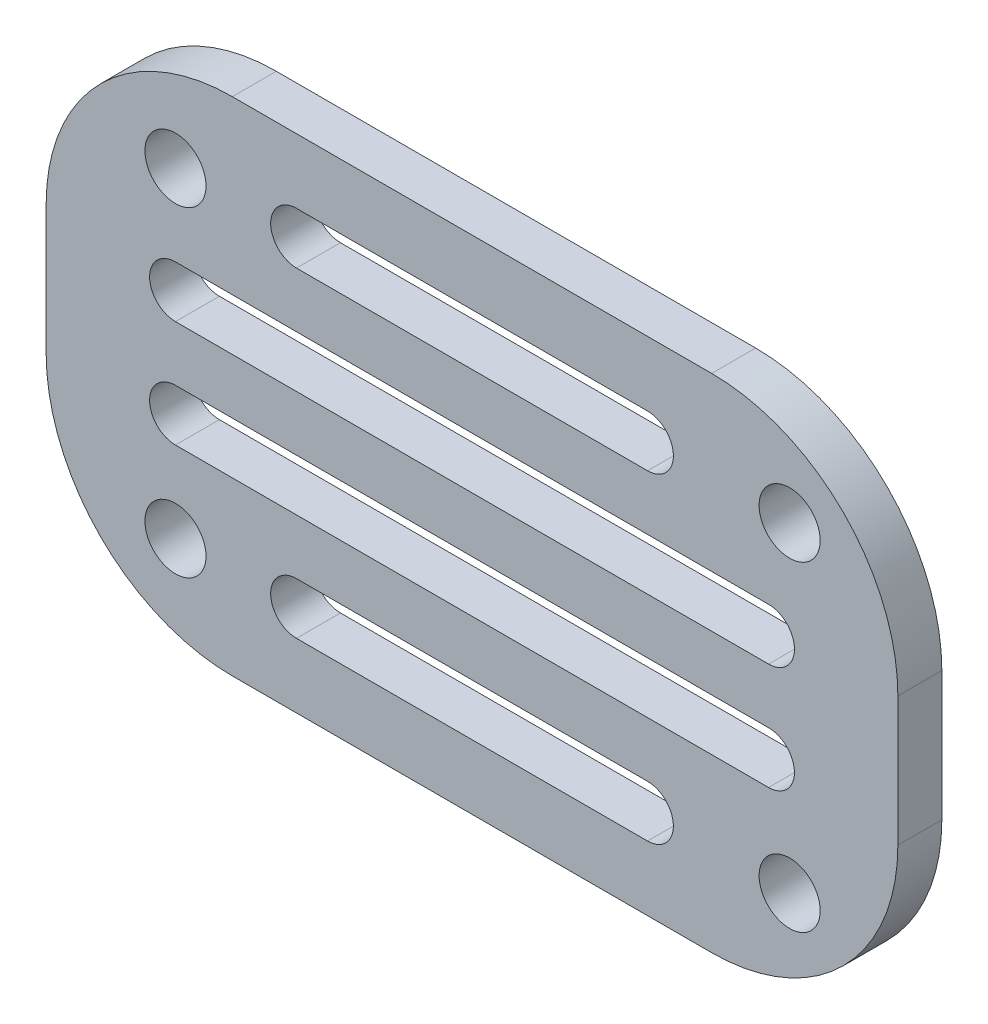
ISO-10303-21;
HEADER;
FILE_DESCRIPTION(('STEP AP214'),'2;1');
FILE_NAME('part.step','',(''),(''),'','','');
FILE_SCHEMA(('AUTOMOTIVE_DESIGN { 1 0 10303 214 1 1 1 1 }'));
ENDSEC;
DATA;
#1=APPLICATION_CONTEXT('core data for automotive mechanical design processes');
#2=APPLICATION_PROTOCOL_DEFINITION('international standard','automotive_design',2000,#1);
#3=PRODUCT_CONTEXT('',#1,'mechanical');
#4=PRODUCT('Part','Part','',(#3));
#5=PRODUCT_RELATED_PRODUCT_CATEGORY('part','',(#4));
#6=PRODUCT_DEFINITION_FORMATION('','',#4);
#7=PRODUCT_DEFINITION_CONTEXT('part definition',#1,'design');
#8=PRODUCT_DEFINITION('design','',#6,#7);
#9=PRODUCT_DEFINITION_SHAPE('','',#8);
#10=(LENGTH_UNIT() NAMED_UNIT(*) SI_UNIT(.MILLI.,.METRE.));
#11=(NAMED_UNIT(*) PLANE_ANGLE_UNIT() SI_UNIT($,.RADIAN.));
#12=(NAMED_UNIT(*) SI_UNIT($,.STERADIAN.) SOLID_ANGLE_UNIT());
#13=UNCERTAINTY_MEASURE_WITH_UNIT(LENGTH_MEASURE(1.E-05),#10,'distance_accuracy_value','');
#14=(GEOMETRIC_REPRESENTATION_CONTEXT(3) GLOBAL_UNCERTAINTY_ASSIGNED_CONTEXT((#13)) GLOBAL_UNIT_ASSIGNED_CONTEXT((#10,
#11,#12)) REPRESENTATION_CONTEXT('',''));
#15=CARTESIAN_POINT('',(0.,0.,0.));
#16=DIRECTION('',(0.,0.,1.));
#17=DIRECTION('',(1.,0.,0.));
#18=AXIS2_PLACEMENT_3D('',#15,#16,#17);
#19=CARTESIAN_POINT('',(-19.05,0.,2.159));
#20=DIRECTION('',(1.,0.,0.));
#21=DIRECTION('',(0.,0.,-1.));
#22=AXIS2_PLACEMENT_3D('',#19,#20,#21);
#23=PLANE('',#22);
#24=DIRECTION('',(0.,-1.,0.));
#25=VECTOR('',#24,1.);
#26=CARTESIAN_POINT('',(-19.05,0.,0.));
#27=LINE('',#26,#25);
#28=CARTESIAN_POINT('',(-19.05,3.17499999999999,0.));
#29=VERTEX_POINT('',#28);
#30=CARTESIAN_POINT('',(-19.05,-3.17499999999999,0.));
#31=VERTEX_POINT('',#30);
#32=EDGE_CURVE('E446',#29,#31,#27,.T.);
#33=ORIENTED_EDGE('',*,*,#32,.T.);
#34=DIRECTION('',(0.,0.,-1.));
#35=VECTOR('',#34,1.);
#36=CARTESIAN_POINT('',(-19.05,-3.17499999999999,2.159));
#37=LINE('',#36,#35);
#38=CARTESIAN_POINT('',(-19.05,-3.17499999999999,2.159));
#39=VERTEX_POINT('',#38);
#40=EDGE_CURVE('E11',#39,#31,#37,.T.);
#41=ORIENTED_EDGE('',*,*,#40,.F.);
#42=DIRECTION('',(0.,-1.,0.));
#43=VECTOR('',#42,1.);
#44=CARTESIAN_POINT('',(-19.05,0.,2.159));
#45=LINE('',#44,#43);
#46=CARTESIAN_POINT('',(-19.05,3.17499999999999,2.159));
#47=VERTEX_POINT('',#46);
#48=EDGE_CURVE('E402',#47,#39,#45,.T.);
#49=ORIENTED_EDGE('',*,*,#48,.F.);
#50=DIRECTION('',(0.,0.,-1.));
#51=VECTOR('',#50,1.);
#52=CARTESIAN_POINT('',(-19.05,3.17499999999999,2.159));
#53=LINE('',#52,#51);
#54=EDGE_CURVE('E430',#47,#29,#53,.T.);
#55=ORIENTED_EDGE('',*,*,#54,.T.);
#56=EDGE_LOOP('',(#33,#41,#49,#55));
#57=FACE_BOUND('',#56,.T.);
#58=ADVANCED_FACE('F41',(#57),#23,.F.);
#59=CARTESIAN_POINT('',(-9.906,-3.17499999999999,2.159));
#60=DIRECTION('',(0.,0.,-1.));
#61=DIRECTION('',(-1.,0.,0.));
#62=AXIS2_PLACEMENT_3D('',#59,#60,#61);
#63=CYLINDRICAL_SURFACE('',#62,9.144);
#64=CARTESIAN_POINT('',(-9.906,-3.17499999999999,0.));
#65=DIRECTION('',(0.,0.,1.));
#66=DIRECTION('',(1.,0.,0.));
#67=AXIS2_PLACEMENT_3D('',#64,#65,#66);
#68=CIRCLE('',#67,9.144);
#69=CARTESIAN_POINT('',(-9.906,-12.319,0.));
#70=VERTEX_POINT('',#69);
#71=EDGE_CURVE('E450',#31,#70,#68,.T.);
#72=ORIENTED_EDGE('',*,*,#71,.T.);
#73=DIRECTION('',(0.,0.,-1.));
#74=VECTOR('',#73,1.);
#75=CARTESIAN_POINT('',(-9.906,-12.319,2.159));
#76=LINE('',#75,#74);
#77=CARTESIAN_POINT('',(-9.906,-12.319,2.159));
#78=VERTEX_POINT('',#77);
#79=EDGE_CURVE('E50',#78,#70,#76,.T.);
#80=ORIENTED_EDGE('',*,*,#79,.F.);
#81=CARTESIAN_POINT('',(-9.906,-3.17499999999999,2.159));
#82=DIRECTION('',(0.,0.,1.));
#83=DIRECTION('',(1.,0.,0.));
#84=AXIS2_PLACEMENT_3D('',#81,#82,#83);
#85=CIRCLE('',#84,9.144);
#86=EDGE_CURVE('E406',#39,#78,#85,.T.);
#87=ORIENTED_EDGE('',*,*,#86,.F.);
#88=ORIENTED_EDGE('',*,*,#40,.T.);
#89=EDGE_LOOP('',(#72,#80,#87,#88));
#90=FACE_BOUND('',#89,.T.);
#91=ADVANCED_FACE('F515',(#90),#63,.T.);
#92=CARTESIAN_POINT('',(0.,-12.319,2.159));
#93=DIRECTION('',(0.,1.,0.));
#94=DIRECTION('',(0.,0.,1.));
#95=AXIS2_PLACEMENT_3D('',#92,#93,#94);
#96=PLANE('',#95);
#97=DIRECTION('',(1.,0.,0.));
#98=VECTOR('',#97,1.);
#99=CARTESIAN_POINT('',(0.,-12.319,0.));
#100=LINE('',#99,#98);
#101=CARTESIAN_POINT('',(13.6347258010329,-12.319,0.));
#102=VERTEX_POINT('',#101);
#103=EDGE_CURVE('E453',#70,#102,#100,.T.);
#104=ORIENTED_EDGE('',*,*,#103,.T.);
#105=DIRECTION('',(0.,0.,-1.));
#106=VECTOR('',#105,1.);
#107=CARTESIAN_POINT('',(13.6347258010329,-12.319,2.159));
#108=LINE('',#107,#106);
#109=CARTESIAN_POINT('',(13.6347258010329,-12.319,2.159));
#110=VERTEX_POINT('',#109);
#111=EDGE_CURVE('E489',#110,#102,#108,.T.);
#112=ORIENTED_EDGE('',*,*,#111,.F.);
#113=DIRECTION('',(1.,0.,0.));
#114=VECTOR('',#113,1.);
#115=CARTESIAN_POINT('',(0.,-12.319,2.159));
#116=LINE('',#115,#114);
#117=EDGE_CURVE('E409',#78,#110,#116,.T.);
#118=ORIENTED_EDGE('',*,*,#117,.F.);
#119=ORIENTED_EDGE('',*,*,#79,.T.);
#120=EDGE_LOOP('',(#104,#112,#118,#119));
#121=FACE_BOUND('',#120,.T.);
#122=ADVANCED_FACE('F498',(#121),#96,.F.);
#123=CARTESIAN_POINT('',(13.6347258010329,-3.175,2.159));
#124=DIRECTION('',(0.,0.,-1.));
#125=DIRECTION('',(-1.,0.,0.));
#126=AXIS2_PLACEMENT_3D('',#123,#124,#125);
#127=CYLINDRICAL_SURFACE('',#126,9.144);
#128=CARTESIAN_POINT('',(13.6347258010329,-3.175,0.));
#129=DIRECTION('',(0.,0.,1.));
#130=DIRECTION('',(1.,0.,0.));
#131=AXIS2_PLACEMENT_3D('',#128,#129,#130);
#132=CIRCLE('',#131,9.144);
#133=CARTESIAN_POINT('',(22.7787258010329,-3.175,0.));
#134=VERTEX_POINT('',#133);
#135=EDGE_CURVE('E456',#102,#134,#132,.T.);
#136=ORIENTED_EDGE('',*,*,#135,.T.);
#137=DIRECTION('',(0.,0.,-1.));
#138=VECTOR('',#137,1.);
#139=CARTESIAN_POINT('',(22.7787258010329,-3.175,2.159));
#140=LINE('',#139,#138);
#141=CARTESIAN_POINT('',(22.7787258010329,-3.175,2.159));
#142=VERTEX_POINT('',#141);
#143=EDGE_CURVE('E486',#142,#134,#140,.T.);
#144=ORIENTED_EDGE('',*,*,#143,.F.);
#145=CARTESIAN_POINT('',(13.6347258010329,-3.175,2.159));
#146=DIRECTION('',(0.,0.,1.));
#147=DIRECTION('',(1.,0.,0.));
#148=AXIS2_PLACEMENT_3D('',#145,#146,#147);
#149=CIRCLE('',#148,9.144);
#150=EDGE_CURVE('E412',#110,#142,#149,.T.);
#151=ORIENTED_EDGE('',*,*,#150,.F.);
#152=ORIENTED_EDGE('',*,*,#111,.T.);
#153=EDGE_LOOP('',(#136,#144,#151,#152));
#154=FACE_BOUND('',#153,.T.);
#155=ADVANCED_FACE('F507',(#154),#127,.T.);
#156=CARTESIAN_POINT('',(22.7787258010329,0.,2.159));
#157=DIRECTION('',(1.,0.,0.));
#158=DIRECTION('',(0.,0.,-1.));
#159=AXIS2_PLACEMENT_3D('',#156,#157,#158);
#160=PLANE('',#159);
#161=DIRECTION('',(0.,-1.,0.));
#162=VECTOR('',#161,1.);
#163=CARTESIAN_POINT('',(22.7787258010329,0.,0.));
#164=LINE('',#163,#162);
#165=CARTESIAN_POINT('',(22.7787258010329,3.175,0.));
#166=VERTEX_POINT('',#165);
#167=EDGE_CURVE('E460',#166,#134,#164,.T.);
#168=ORIENTED_EDGE('',*,*,#167,.F.);
#169=DIRECTION('',(0.,0.,-1.));
#170=VECTOR('',#169,1.);
#171=CARTESIAN_POINT('',(22.7787258010329,3.175,2.159));
#172=LINE('',#171,#170);
#173=CARTESIAN_POINT('',(22.7787258010329,3.175,2.159));
#174=VERTEX_POINT('',#173);
#175=EDGE_CURVE('E483',#174,#166,#172,.T.);
#176=ORIENTED_EDGE('',*,*,#175,.F.);
#177=DIRECTION('',(0.,-1.,0.));
#178=VECTOR('',#177,1.);
#179=CARTESIAN_POINT('',(22.7787258010329,0.,2.159));
#180=LINE('',#179,#178);
#181=EDGE_CURVE('E415',#174,#142,#180,.T.);
#182=ORIENTED_EDGE('',*,*,#181,.T.);
#183=ORIENTED_EDGE('',*,*,#143,.T.);
#184=EDGE_LOOP('',(#168,#176,#182,#183));
#185=FACE_BOUND('',#184,.T.);
#186=ADVANCED_FACE('F529',(#185),#160,.T.);
#187=CARTESIAN_POINT('',(13.6347258010329,3.175,2.159));
#188=DIRECTION('',(0.,0.,-1.));
#189=DIRECTION('',(-1.,0.,0.));
#190=AXIS2_PLACEMENT_3D('',#187,#188,#189);
#191=CYLINDRICAL_SURFACE('',#190,9.144);
#192=CARTESIAN_POINT('',(13.6347258010329,3.175,0.));
#193=DIRECTION('',(0.,0.,1.));
#194=DIRECTION('',(1.,0.,0.));
#195=AXIS2_PLACEMENT_3D('',#192,#193,#194);
#196=CIRCLE('',#195,9.144);
#197=CARTESIAN_POINT('',(13.6347258010329,12.319,0.));
#198=VERTEX_POINT('',#197);
#199=EDGE_CURVE('E464',#198,#166,#196,.F.);
#200=ORIENTED_EDGE('',*,*,#199,.F.);
#201=DIRECTION('',(0.,0.,-1.));
#202=VECTOR('',#201,1.);
#203=CARTESIAN_POINT('',(13.6347258010329,12.319,2.159));
#204=LINE('',#203,#202);
#205=CARTESIAN_POINT('',(13.6347258010329,12.319,2.159));
#206=VERTEX_POINT('',#205);
#207=EDGE_CURVE('E480',#206,#198,#204,.T.);
#208=ORIENTED_EDGE('',*,*,#207,.F.);
#209=CARTESIAN_POINT('',(13.6347258010329,3.175,2.159));
#210=DIRECTION('',(0.,0.,1.));
#211=DIRECTION('',(1.,0.,0.));
#212=AXIS2_PLACEMENT_3D('',#209,#210,#211);
#213=CIRCLE('',#212,9.144);
#214=EDGE_CURVE('E419',#206,#174,#213,.F.);
#215=ORIENTED_EDGE('',*,*,#214,.T.);
#216=ORIENTED_EDGE('',*,*,#175,.T.);
#217=EDGE_LOOP('',(#200,#208,#215,#216));
#218=FACE_BOUND('',#217,.T.);
#219=ADVANCED_FACE('F527',(#218),#191,.T.);
#220=CARTESIAN_POINT('',(0.,12.319,2.159));
#221=DIRECTION('',(0.,1.,0.));
#222=DIRECTION('',(0.,0.,1.));
#223=AXIS2_PLACEMENT_3D('',#220,#221,#222);
#224=PLANE('',#223);
#225=DIRECTION('',(1.,0.,0.));
#226=VECTOR('',#225,1.);
#227=CARTESIAN_POINT('',(0.,12.319,0.));
#228=LINE('',#227,#226);
#229=CARTESIAN_POINT('',(-9.906,12.319,0.));
#230=VERTEX_POINT('',#229);
#231=EDGE_CURVE('E468',#230,#198,#228,.T.);
#232=ORIENTED_EDGE('',*,*,#231,.F.);
#233=DIRECTION('',(0.,0.,-1.));
#234=VECTOR('',#233,1.);
#235=CARTESIAN_POINT('',(-9.906,12.319,2.159));
#236=LINE('',#235,#234);
#237=CARTESIAN_POINT('',(-9.906,12.319,2.159));
#238=VERTEX_POINT('',#237);
#239=EDGE_CURVE('E477',#238,#230,#236,.T.);
#240=ORIENTED_EDGE('',*,*,#239,.F.);
#241=DIRECTION('',(1.,0.,0.));
#242=VECTOR('',#241,1.);
#243=CARTESIAN_POINT('',(0.,12.319,2.159));
#244=LINE('',#243,#242);
#245=EDGE_CURVE('E423',#238,#206,#244,.T.);
#246=ORIENTED_EDGE('',*,*,#245,.T.);
#247=ORIENTED_EDGE('',*,*,#207,.T.);
#248=EDGE_LOOP('',(#232,#240,#246,#247));
#249=FACE_BOUND('',#248,.T.);
#250=ADVANCED_FACE('F522',(#249),#224,.T.);
#251=CARTESIAN_POINT('',(17.4625,-7.874,2.159));
#252=DIRECTION('',(0.,0.,-1.));
#253=DIRECTION('',(-1.,0.,0.));
#254=AXIS2_PLACEMENT_3D('',#251,#252,#253);
#255=CYLINDRICAL_SURFACE('',#254,1.5);
#256=CARTESIAN_POINT('',(17.4625,-7.874,2.159));
#257=DIRECTION('',(0.,0.,1.));
#258=DIRECTION('',(1.,0.,0.));
#259=AXIS2_PLACEMENT_3D('',#256,#257,#258);
#260=CIRCLE('',#259,1.5);
#261=CARTESIAN_POINT('',(18.9625,-7.874,2.159));
#262=VERTEX_POINT('',#261);
#263=EDGE_CURVE('E398',#262,#262,#260,.T.);
#264=ORIENTED_EDGE('',*,*,#263,.T.);
#265=EDGE_LOOP('',(#264));
#266=FACE_BOUND('',#265,.T.);
#267=CARTESIAN_POINT('',(17.4625,-7.874,0.));
#268=DIRECTION('',(0.,0.,1.));
#269=DIRECTION('',(1.,0.,0.));
#270=AXIS2_PLACEMENT_3D('',#267,#268,#269);
#271=CIRCLE('',#270,1.5);
#272=CARTESIAN_POINT('',(18.9625,-7.874,0.));
#273=VERTEX_POINT('',#272);
#274=EDGE_CURVE('E442',#273,#273,#271,.T.);
#275=ORIENTED_EDGE('',*,*,#274,.F.);
#276=EDGE_LOOP('',(#275));
#277=FACE_BOUND('',#276,.T.);
#278=ADVANCED_FACE('F546',(#266,#277),#255,.F.);
#279=CARTESIAN_POINT('',(17.4625,7.874,2.159));
#280=DIRECTION('',(0.,0.,-1.));
#281=DIRECTION('',(-1.,0.,0.));
#282=AXIS2_PLACEMENT_3D('',#279,#280,#281);
#283=CYLINDRICAL_SURFACE('',#282,1.5);
#284=CARTESIAN_POINT('',(17.4625,7.874,2.159));
#285=DIRECTION('',(0.,0.,1.));
#286=DIRECTION('',(1.,0.,0.));
#287=AXIS2_PLACEMENT_3D('',#284,#285,#286);
#288=CIRCLE('',#287,1.5);
#289=CARTESIAN_POINT('',(18.9625,7.874,2.159));
#290=VERTEX_POINT('',#289);
#291=EDGE_CURVE('E394',#290,#290,#288,.T.);
#292=ORIENTED_EDGE('',*,*,#291,.T.);
#293=EDGE_LOOP('',(#292));
#294=FACE_BOUND('',#293,.T.);
#295=CARTESIAN_POINT('',(17.4625,7.874,0.));
#296=DIRECTION('',(0.,0.,1.));
#297=DIRECTION('',(1.,0.,0.));
#298=AXIS2_PLACEMENT_3D('',#295,#296,#297);
#299=CIRCLE('',#298,1.5);
#300=CARTESIAN_POINT('',(18.9625,7.874,0.));
#301=VERTEX_POINT('',#300);
#302=EDGE_CURVE('E438',#301,#301,#299,.T.);
#303=ORIENTED_EDGE('',*,*,#302,.F.);
#304=EDGE_LOOP('',(#303));
#305=FACE_BOUND('',#304,.T.);
#306=ADVANCED_FACE('F549',(#294,#305),#283,.F.);
#307=CARTESIAN_POINT('',(-12.7,-7.874,2.159));
#308=DIRECTION('',(0.,0.,-1.));
#309=DIRECTION('',(-1.,0.,0.));
#310=AXIS2_PLACEMENT_3D('',#307,#308,#309);
#311=CYLINDRICAL_SURFACE('',#310,1.5);
#312=CARTESIAN_POINT('',(-12.7,-7.874,2.159));
#313=DIRECTION('',(0.,0.,1.));
#314=DIRECTION('',(1.,0.,0.));
#315=AXIS2_PLACEMENT_3D('',#312,#313,#314);
#316=CIRCLE('',#315,1.5);
#317=CARTESIAN_POINT('',(-11.2,-7.874,2.159));
#318=VERTEX_POINT('',#317);
#319=EDGE_CURVE('E389',#318,#318,#316,.T.);
#320=ORIENTED_EDGE('',*,*,#319,.T.);
#321=EDGE_LOOP('',(#320));
#322=FACE_BOUND('',#321,.T.);
#323=CARTESIAN_POINT('',(-12.7,-7.874,0.));
#324=DIRECTION('',(0.,0.,1.));
#325=DIRECTION('',(1.,0.,0.));
#326=AXIS2_PLACEMENT_3D('',#323,#324,#325);
#327=CIRCLE('',#326,1.5);
#328=CARTESIAN_POINT('',(-11.2,-7.874,0.));
#329=VERTEX_POINT('',#328);
#330=EDGE_CURVE('E434',#329,#329,#327,.T.);
#331=ORIENTED_EDGE('',*,*,#330,.F.);
#332=EDGE_LOOP('',(#331));
#333=FACE_BOUND('',#332,.T.);
#334=ADVANCED_FACE('F552',(#322,#333),#311,.F.);
#335=CARTESIAN_POINT('',(-12.7,7.874,2.159));
#336=DIRECTION('',(0.,0.,-1.));
#337=DIRECTION('',(-1.,0.,0.));
#338=AXIS2_PLACEMENT_3D('',#335,#336,#337);
#339=CYLINDRICAL_SURFACE('',#338,1.5);
#340=CARTESIAN_POINT('',(-12.7,7.874,2.159));
#341=DIRECTION('',(0.,0.,1.));
#342=DIRECTION('',(1.,0.,0.));
#343=AXIS2_PLACEMENT_3D('',#340,#341,#342);
#344=CIRCLE('',#343,1.5);
#345=CARTESIAN_POINT('',(-11.2,7.874,2.159));
#346=VERTEX_POINT('',#345);
#347=EDGE_CURVE('E385',#346,#346,#344,.T.);
#348=ORIENTED_EDGE('',*,*,#347,.T.);
#349=EDGE_LOOP('',(#348));
#350=FACE_BOUND('',#349,.T.);
#351=CARTESIAN_POINT('',(-12.7,7.874,0.));
#352=DIRECTION('',(0.,0.,1.));
#353=DIRECTION('',(1.,0.,0.));
#354=AXIS2_PLACEMENT_3D('',#351,#352,#353);
#355=CIRCLE('',#354,1.5);
#356=CARTESIAN_POINT('',(-11.2,7.874,0.));
#357=VERTEX_POINT('',#356);
#358=EDGE_CURVE('E250',#357,#357,#355,.T.);
#359=ORIENTED_EDGE('',*,*,#358,.F.);
#360=EDGE_LOOP('',(#359));
#361=FACE_BOUND('',#360,.T.);
#362=ADVANCED_FACE('F43',(#350,#361),#339,.F.);
#363=CARTESIAN_POINT('',(-9.906,3.17499999999999,2.159));
#364=DIRECTION('',(0.,0.,-1.));
#365=DIRECTION('',(-1.,0.,0.));
#366=AXIS2_PLACEMENT_3D('',#363,#364,#365);
#367=CYLINDRICAL_SURFACE('',#366,9.144);
#368=CARTESIAN_POINT('',(-9.906,3.17499999999999,0.));
#369=DIRECTION('',(0.,0.,1.));
#370=DIRECTION('',(1.,0.,0.));
#371=AXIS2_PLACEMENT_3D('',#368,#369,#370);
#372=CIRCLE('',#371,9.144);
#373=EDGE_CURVE('E390',#230,#29,#372,.T.);
#374=ORIENTED_EDGE('',*,*,#373,.T.);
#375=ORIENTED_EDGE('',*,*,#54,.F.);
#376=CARTESIAN_POINT('',(-9.906,3.17499999999999,2.159));
#377=DIRECTION('',(0.,0.,1.));
#378=DIRECTION('',(1.,0.,0.));
#379=AXIS2_PLACEMENT_3D('',#376,#377,#378);
#380=CIRCLE('',#379,9.144);
#381=EDGE_CURVE('E427',#238,#47,#380,.T.);
#382=ORIENTED_EDGE('',*,*,#381,.F.);
#383=ORIENTED_EDGE('',*,*,#239,.T.);
#384=EDGE_LOOP('',(#374,#375,#382,#383));
#385=FACE_BOUND('',#384,.T.);
#386=ADVANCED_FACE('F559',(#385),#367,.T.);
#387=CARTESIAN_POINT('',(0.,0.,2.159));
#388=DIRECTION('',(0.,0.,1.));
#389=DIRECTION('',(1.,0.,0.));
#390=AXIS2_PLACEMENT_3D('',#387,#388,#389);
#391=PLANE('',#390);
#392=CARTESIAN_POINT('',(-6.755,7.87399999999999,2.159));
#393=DIRECTION('',(0.,0.,1.));
#394=DIRECTION('',(1.,0.,0.));
#395=AXIS2_PLACEMENT_3D('',#392,#393,#394);
#396=CIRCLE('',#395,1.27);
#397=CARTESIAN_POINT('',(-6.755,9.14399999999999,2.159));
#398=VERTEX_POINT('',#397);
#399=CARTESIAN_POINT('',(-6.755,6.604,2.159));
#400=VERTEX_POINT('',#399);
#401=EDGE_CURVE('E57',#398,#400,#396,.T.);
#402=ORIENTED_EDGE('',*,*,#401,.F.);
#403=DIRECTION('',(-1.,0.,0.));
#404=VECTOR('',#403,1.);
#405=CARTESIAN_POINT('',(-6.755,9.14399999999999,2.159));
#406=LINE('',#405,#404);
#407=CARTESIAN_POINT('',(10.4837258010329,9.14399999999999,2.159));
#408=VERTEX_POINT('',#407);
#409=EDGE_CURVE('E227',#408,#398,#406,.T.);
#410=ORIENTED_EDGE('',*,*,#409,.F.);
#411=CARTESIAN_POINT('',(10.4837258010329,7.87399999999999,2.159));
#412=DIRECTION('',(0.,0.,1.));
#413=DIRECTION('',(1.,0.,0.));
#414=AXIS2_PLACEMENT_3D('',#411,#412,#413);
#415=CIRCLE('',#414,1.27);
#416=CARTESIAN_POINT('',(10.4837258010329,6.604,2.159));
#417=VERTEX_POINT('',#416);
#418=EDGE_CURVE('E231',#417,#408,#415,.T.);
#419=ORIENTED_EDGE('',*,*,#418,.F.);
#420=DIRECTION('',(1.,0.,0.));
#421=VECTOR('',#420,1.);
#422=CARTESIAN_POINT('',(-6.755,6.604,2.159));
#423=LINE('',#422,#421);
#424=EDGE_CURVE('E240',#400,#417,#423,.T.);
#425=ORIENTED_EDGE('',*,*,#424,.F.);
#426=EDGE_LOOP('',(#402,#410,#419,#425));
#427=FACE_BOUND('',#426,.T.);
#428=CARTESIAN_POINT('',(-12.7,2.62466666666666,2.159));
#429=DIRECTION('',(0.,0.,1.));
#430=DIRECTION('',(1.,0.,0.));
#431=AXIS2_PLACEMENT_3D('',#428,#429,#430);
#432=CIRCLE('',#431,1.27);
#433=CARTESIAN_POINT('',(-12.7,3.89466666666667,2.159));
#434=VERTEX_POINT('',#433);
#435=CARTESIAN_POINT('',(-12.7,1.35466666666666,2.159));
#436=VERTEX_POINT('',#435);
#437=EDGE_CURVE('E65',#434,#436,#432,.T.);
#438=ORIENTED_EDGE('',*,*,#437,.F.);
#439=DIRECTION('',(-1.,0.,0.));
#440=VECTOR('',#439,1.);
#441=CARTESIAN_POINT('',(-12.7,3.89466666666667,2.159));
#442=LINE('',#441,#440);
#443=CARTESIAN_POINT('',(16.4287258010329,3.89466666666667,2.159));
#444=VERTEX_POINT('',#443);
#445=EDGE_CURVE('E261',#444,#434,#442,.T.);
#446=ORIENTED_EDGE('',*,*,#445,.F.);
#447=CARTESIAN_POINT('',(16.4287258010329,2.62466666666667,2.159));
#448=DIRECTION('',(0.,0.,1.));
#449=DIRECTION('',(1.,0.,0.));
#450=AXIS2_PLACEMENT_3D('',#447,#448,#449);
#451=CIRCLE('',#450,1.27);
#452=CARTESIAN_POINT('',(16.4287258010329,1.35466666666667,2.159));
#453=VERTEX_POINT('',#452);
#454=EDGE_CURVE('E281',#453,#444,#451,.T.);
#455=ORIENTED_EDGE('',*,*,#454,.F.);
#456=DIRECTION('',(1.,0.,0.));
#457=VECTOR('',#456,1.);
#458=CARTESIAN_POINT('',(-12.7,1.35466666666666,2.159));
#459=LINE('',#458,#457);
#460=EDGE_CURVE('E276',#436,#453,#459,.T.);
#461=ORIENTED_EDGE('',*,*,#460,.F.);
#462=EDGE_LOOP('',(#438,#446,#455,#461));
#463=FACE_BOUND('',#462,.T.);
#464=CARTESIAN_POINT('',(-12.7,-2.62466666666666,2.159));
#465=DIRECTION('',(0.,0.,1.));
#466=DIRECTION('',(1.,0.,0.));
#467=AXIS2_PLACEMENT_3D('',#464,#465,#466);
#468=CIRCLE('',#467,1.27);
#469=CARTESIAN_POINT('',(-12.7,-1.35466666666666,2.159));
#470=VERTEX_POINT('',#469);
#471=CARTESIAN_POINT('',(-12.7,-3.89466666666666,2.159));
#472=VERTEX_POINT('',#471);
#473=EDGE_CURVE('E316',#470,#472,#468,.T.);
#474=ORIENTED_EDGE('',*,*,#473,.F.);
#475=DIRECTION('',(-1.,0.,0.));
#476=VECTOR('',#475,1.);
#477=CARTESIAN_POINT('',(-12.7,-1.35466666666666,2.159));
#478=LINE('',#477,#476);
#479=CARTESIAN_POINT('',(16.4287258010329,-1.35466666666666,2.159));
#480=VERTEX_POINT('',#479);
#481=EDGE_CURVE('E303',#480,#470,#478,.T.);
#482=ORIENTED_EDGE('',*,*,#481,.F.);
#483=CARTESIAN_POINT('',(16.4287258010329,-2.62466666666666,2.159));
#484=DIRECTION('',(0.,0.,1.));
#485=DIRECTION('',(1.,0.,0.));
#486=AXIS2_PLACEMENT_3D('',#483,#484,#485);
#487=CIRCLE('',#486,1.27);
#488=CARTESIAN_POINT('',(16.4287258010329,-3.89466666666666,2.159));
#489=VERTEX_POINT('',#488);
#490=EDGE_CURVE('E324',#489,#480,#487,.T.);
#491=ORIENTED_EDGE('',*,*,#490,.F.);
#492=DIRECTION('',(1.,0.,0.));
#493=VECTOR('',#492,1.);
#494=CARTESIAN_POINT('',(-12.7,-3.89466666666666,2.159));
#495=LINE('',#494,#493);
#496=EDGE_CURVE('E319',#472,#489,#495,.T.);
#497=ORIENTED_EDGE('',*,*,#496,.F.);
#498=EDGE_LOOP('',(#474,#482,#491,#497));
#499=FACE_BOUND('',#498,.T.);
#500=CARTESIAN_POINT('',(-6.75499999999999,-7.87399999999999,2.159));
#501=DIRECTION('',(0.,0.,1.));
#502=DIRECTION('',(1.,0.,0.));
#503=AXIS2_PLACEMENT_3D('',#500,#501,#502);
#504=CIRCLE('',#503,1.27);
#505=CARTESIAN_POINT('',(-6.75499999999999,-6.60399999999999,2.159));
#506=VERTEX_POINT('',#505);
#507=CARTESIAN_POINT('',(-6.75499999999999,-9.14399999999999,2.159));
#508=VERTEX_POINT('',#507);
#509=EDGE_CURVE('E360',#506,#508,#504,.T.);
#510=ORIENTED_EDGE('',*,*,#509,.F.);
#511=DIRECTION('',(-1.,0.,0.));
#512=VECTOR('',#511,1.);
#513=CARTESIAN_POINT('',(-6.75499999999999,-6.60399999999999,2.159));
#514=LINE('',#513,#512);
#515=CARTESIAN_POINT('',(10.4837258010329,-6.60399999999999,2.159));
#516=VERTEX_POINT('',#515);
#517=EDGE_CURVE('E347',#516,#506,#514,.T.);
#518=ORIENTED_EDGE('',*,*,#517,.F.);
#519=CARTESIAN_POINT('',(10.4837258010329,-7.87399999999999,2.159));
#520=DIRECTION('',(0.,0.,1.));
#521=DIRECTION('',(1.,0.,0.));
#522=AXIS2_PLACEMENT_3D('',#519,#520,#521);
#523=CIRCLE('',#522,1.27);
#524=CARTESIAN_POINT('',(10.4837258010329,-9.14399999999999,2.159));
#525=VERTEX_POINT('',#524);
#526=EDGE_CURVE('E367',#525,#516,#523,.T.);
#527=ORIENTED_EDGE('',*,*,#526,.F.);
#528=DIRECTION('',(1.,0.,0.));
#529=VECTOR('',#528,1.);
#530=CARTESIAN_POINT('',(-6.75499999999999,-9.14399999999999,2.159));
#531=LINE('',#530,#529);
#532=EDGE_CURVE('E363',#508,#525,#531,.T.);
#533=ORIENTED_EDGE('',*,*,#532,.F.);
#534=EDGE_LOOP('',(#510,#518,#527,#533));
#535=FACE_BOUND('',#534,.T.);
#536=ORIENTED_EDGE('',*,*,#347,.F.);
#537=EDGE_LOOP('',(#536));
#538=FACE_BOUND('',#537,.T.);
#539=ORIENTED_EDGE('',*,*,#319,.F.);
#540=EDGE_LOOP('',(#539));
#541=FACE_BOUND('',#540,.T.);
#542=ORIENTED_EDGE('',*,*,#291,.F.);
#543=EDGE_LOOP('',(#542));
#544=FACE_BOUND('',#543,.T.);
#545=ORIENTED_EDGE('',*,*,#263,.F.);
#546=EDGE_LOOP('',(#545));
#547=FACE_BOUND('',#546,.T.);
#548=ORIENTED_EDGE('',*,*,#48,.T.);
#549=ORIENTED_EDGE('',*,*,#86,.T.);
#550=ORIENTED_EDGE('',*,*,#117,.T.);
#551=ORIENTED_EDGE('',*,*,#150,.T.);
#552=ORIENTED_EDGE('',*,*,#181,.F.);
#553=ORIENTED_EDGE('',*,*,#214,.F.);
#554=ORIENTED_EDGE('',*,*,#245,.F.);
#555=ORIENTED_EDGE('',*,*,#381,.T.);
#556=EDGE_LOOP('',(#548,#549,#550,#551,#552,#553,#554,#555));
#557=FACE_BOUND('',#556,.T.);
#558=ADVANCED_FACE('F511',(#427,#463,#499,#535,#538,#541,#544,#547,#557),#391,.T.);
#559=CARTESIAN_POINT('',(0.,0.,0.));
#560=DIRECTION('',(0.,0.,1.));
#561=DIRECTION('',(1.,0.,0.));
#562=AXIS2_PLACEMENT_3D('',#559,#560,#561);
#563=PLANE('',#562);
#564=DIRECTION('',(-1.,0.,0.));
#565=VECTOR('',#564,1.);
#566=CARTESIAN_POINT('',(-6.755,9.14399999999999,0.));
#567=LINE('',#566,#565);
#568=CARTESIAN_POINT('',(10.4837258010329,9.14399999999999,0.));
#569=VERTEX_POINT('',#568);
#570=CARTESIAN_POINT('',(-6.755,9.14399999999999,0.));
#571=VERTEX_POINT('',#570);
#572=EDGE_CURVE('E212',#569,#571,#567,.T.);
#573=ORIENTED_EDGE('',*,*,#572,.T.);
#574=CARTESIAN_POINT('',(-6.755,7.87399999999999,0.));
#575=DIRECTION('',(0.,0.,1.));
#576=DIRECTION('',(1.,0.,0.));
#577=AXIS2_PLACEMENT_3D('',#574,#575,#576);
#578=CIRCLE('',#577,1.27);
#579=CARTESIAN_POINT('',(-6.755,6.604,0.));
#580=VERTEX_POINT('',#579);
#581=EDGE_CURVE('E205',#571,#580,#578,.T.);
#582=ORIENTED_EDGE('',*,*,#581,.T.);
#583=DIRECTION('',(1.,0.,0.));
#584=VECTOR('',#583,1.);
#585=CARTESIAN_POINT('',(-6.755,6.604,0.));
#586=LINE('',#585,#584);
#587=CARTESIAN_POINT('',(10.4837258010329,6.604,0.));
#588=VERTEX_POINT('',#587);
#589=EDGE_CURVE('E216',#580,#588,#586,.T.);
#590=ORIENTED_EDGE('',*,*,#589,.T.);
#591=CARTESIAN_POINT('',(10.4837258010329,7.87399999999999,0.));
#592=DIRECTION('',(0.,0.,1.));
#593=DIRECTION('',(1.,0.,0.));
#594=AXIS2_PLACEMENT_3D('',#591,#592,#593);
#595=CIRCLE('',#594,1.27);
#596=EDGE_CURVE('E221',#588,#569,#595,.T.);
#597=ORIENTED_EDGE('',*,*,#596,.T.);
#598=EDGE_LOOP('',(#573,#582,#590,#597));
#599=FACE_BOUND('',#598,.T.);
#600=DIRECTION('',(-1.,0.,0.));
#601=VECTOR('',#600,1.);
#602=CARTESIAN_POINT('',(-12.7,3.89466666666667,0.));
#603=LINE('',#602,#601);
#604=CARTESIAN_POINT('',(16.4287258010329,3.89466666666667,0.));
#605=VERTEX_POINT('',#604);
#606=CARTESIAN_POINT('',(-12.7,3.89466666666667,0.));
#607=VERTEX_POINT('',#606);
#608=EDGE_CURVE('E269',#605,#607,#603,.T.);
#609=ORIENTED_EDGE('',*,*,#608,.T.);
#610=CARTESIAN_POINT('',(-12.7,2.62466666666666,0.));
#611=DIRECTION('',(0.,0.,1.));
#612=DIRECTION('',(1.,0.,0.));
#613=AXIS2_PLACEMENT_3D('',#610,#611,#612);
#614=CIRCLE('',#613,1.27);
#615=CARTESIAN_POINT('',(-12.7,1.35466666666666,0.));
#616=VERTEX_POINT('',#615);
#617=EDGE_CURVE('E256',#607,#616,#614,.T.);
#618=ORIENTED_EDGE('',*,*,#617,.T.);
#619=DIRECTION('',(1.,0.,0.));
#620=VECTOR('',#619,1.);
#621=CARTESIAN_POINT('',(-12.7,1.35466666666666,0.));
#622=LINE('',#621,#620);
#623=CARTESIAN_POINT('',(16.4287258010329,1.35466666666667,0.));
#624=VERTEX_POINT('',#623);
#625=EDGE_CURVE('E260',#616,#624,#622,.T.);
#626=ORIENTED_EDGE('',*,*,#625,.T.);
#627=CARTESIAN_POINT('',(16.4287258010329,2.62466666666667,0.));
#628=DIRECTION('',(0.,0.,1.));
#629=DIRECTION('',(1.,0.,0.));
#630=AXIS2_PLACEMENT_3D('',#627,#628,#629);
#631=CIRCLE('',#630,1.27);
#632=EDGE_CURVE('E265',#624,#605,#631,.T.);
#633=ORIENTED_EDGE('',*,*,#632,.T.);
#634=EDGE_LOOP('',(#609,#618,#626,#633));
#635=FACE_BOUND('',#634,.T.);
#636=DIRECTION('',(-1.,0.,0.));
#637=VECTOR('',#636,1.);
#638=CARTESIAN_POINT('',(-12.7,-1.35466666666666,0.));
#639=LINE('',#638,#637);
#640=CARTESIAN_POINT('',(16.4287258010329,-1.35466666666666,0.));
#641=VERTEX_POINT('',#640);
#642=CARTESIAN_POINT('',(-12.7,-1.35466666666666,0.));
#643=VERTEX_POINT('',#642);
#644=EDGE_CURVE('E311',#641,#643,#639,.T.);
#645=ORIENTED_EDGE('',*,*,#644,.T.);
#646=CARTESIAN_POINT('',(-12.7,-2.62466666666666,0.));
#647=DIRECTION('',(0.,0.,1.));
#648=DIRECTION('',(1.,0.,0.));
#649=AXIS2_PLACEMENT_3D('',#646,#647,#648);
#650=CIRCLE('',#649,1.27);
#651=CARTESIAN_POINT('',(-12.7,-3.89466666666666,0.));
#652=VERTEX_POINT('',#651);
#653=EDGE_CURVE('E298',#643,#652,#650,.T.);
#654=ORIENTED_EDGE('',*,*,#653,.T.);
#655=DIRECTION('',(1.,0.,0.));
#656=VECTOR('',#655,1.);
#657=CARTESIAN_POINT('',(-12.7,-3.89466666666666,0.));
#658=LINE('',#657,#656);
#659=CARTESIAN_POINT('',(16.4287258010329,-3.89466666666666,0.));
#660=VERTEX_POINT('',#659);
#661=EDGE_CURVE('E302',#652,#660,#658,.T.);
#662=ORIENTED_EDGE('',*,*,#661,.T.);
#663=CARTESIAN_POINT('',(16.4287258010329,-2.62466666666666,0.));
#664=DIRECTION('',(0.,0.,1.));
#665=DIRECTION('',(1.,0.,0.));
#666=AXIS2_PLACEMENT_3D('',#663,#664,#665);
#667=CIRCLE('',#666,1.27);
#668=EDGE_CURVE('E307',#660,#641,#667,.T.);
#669=ORIENTED_EDGE('',*,*,#668,.T.);
#670=EDGE_LOOP('',(#645,#654,#662,#669));
#671=FACE_BOUND('',#670,.T.);
#672=DIRECTION('',(-1.,0.,0.));
#673=VECTOR('',#672,1.);
#674=CARTESIAN_POINT('',(-6.75499999999999,-6.60399999999999,0.));
#675=LINE('',#674,#673);
#676=CARTESIAN_POINT('',(10.4837258010329,-6.60399999999999,0.));
#677=VERTEX_POINT('',#676);
#678=CARTESIAN_POINT('',(-6.75499999999999,-6.60399999999999,0.));
#679=VERTEX_POINT('',#678);
#680=EDGE_CURVE('E355',#677,#679,#675,.T.);
#681=ORIENTED_EDGE('',*,*,#680,.T.);
#682=CARTESIAN_POINT('',(-6.75499999999999,-7.87399999999999,0.));
#683=DIRECTION('',(0.,0.,1.));
#684=DIRECTION('',(1.,0.,0.));
#685=AXIS2_PLACEMENT_3D('',#682,#683,#684);
#686=CIRCLE('',#685,1.27);
#687=CARTESIAN_POINT('',(-6.75499999999999,-9.14399999999999,0.));
#688=VERTEX_POINT('',#687);
#689=EDGE_CURVE('E342',#679,#688,#686,.T.);
#690=ORIENTED_EDGE('',*,*,#689,.T.);
#691=DIRECTION('',(1.,0.,0.));
#692=VECTOR('',#691,1.);
#693=CARTESIAN_POINT('',(-6.75499999999999,-9.14399999999999,0.));
#694=LINE('',#693,#692);
#695=CARTESIAN_POINT('',(10.4837258010329,-9.14399999999999,0.));
#696=VERTEX_POINT('',#695);
#697=EDGE_CURVE('E346',#688,#696,#694,.T.);
#698=ORIENTED_EDGE('',*,*,#697,.T.);
#699=CARTESIAN_POINT('',(10.4837258010329,-7.87399999999999,0.));
#700=DIRECTION('',(0.,0.,1.));
#701=DIRECTION('',(1.,0.,0.));
#702=AXIS2_PLACEMENT_3D('',#699,#700,#701);
#703=CIRCLE('',#702,1.27);
#704=EDGE_CURVE('E351',#696,#677,#703,.T.);
#705=ORIENTED_EDGE('',*,*,#704,.T.);
#706=EDGE_LOOP('',(#681,#690,#698,#705));
#707=FACE_BOUND('',#706,.T.);
#708=ORIENTED_EDGE('',*,*,#358,.T.);
#709=EDGE_LOOP('',(#708));
#710=FACE_BOUND('',#709,.T.);
#711=ORIENTED_EDGE('',*,*,#330,.T.);
#712=EDGE_LOOP('',(#711));
#713=FACE_BOUND('',#712,.T.);
#714=ORIENTED_EDGE('',*,*,#302,.T.);
#715=EDGE_LOOP('',(#714));
#716=FACE_BOUND('',#715,.T.);
#717=ORIENTED_EDGE('',*,*,#274,.T.);
#718=EDGE_LOOP('',(#717));
#719=FACE_BOUND('',#718,.T.);
#720=ORIENTED_EDGE('',*,*,#32,.F.);
#721=ORIENTED_EDGE('',*,*,#373,.F.);
#722=ORIENTED_EDGE('',*,*,#231,.T.);
#723=ORIENTED_EDGE('',*,*,#199,.T.);
#724=ORIENTED_EDGE('',*,*,#167,.T.);
#725=ORIENTED_EDGE('',*,*,#135,.F.);
#726=ORIENTED_EDGE('',*,*,#103,.F.);
#727=ORIENTED_EDGE('',*,*,#71,.F.);
#728=EDGE_LOOP('',(#720,#721,#722,#723,#724,#725,#726,#727));
#729=FACE_BOUND('',#728,.T.);
#730=ADVANCED_FACE('F223',(#599,#635,#671,#707,#710,#713,#716,#719,#729),#563,.F.);
#731=CARTESIAN_POINT('',(-6.75499999999999,-7.87399999999999,0.));
#732=DIRECTION('',(0.,0.,1.));
#733=DIRECTION('',(1.,0.,0.));
#734=AXIS2_PLACEMENT_3D('',#731,#732,#733);
#735=CYLINDRICAL_SURFACE('',#734,1.27);
#736=ORIENTED_EDGE('',*,*,#509,.T.);
#737=DIRECTION('',(0.,0.,1.));
#738=VECTOR('',#737,1.);
#739=CARTESIAN_POINT('',(-6.75499999999999,-9.14399999999999,0.));
#740=LINE('',#739,#738);
#741=EDGE_CURVE('E359',#688,#508,#740,.T.);
#742=ORIENTED_EDGE('',*,*,#741,.F.);
#743=ORIENTED_EDGE('',*,*,#689,.F.);
#744=DIRECTION('',(0.,0.,1.));
#745=VECTOR('',#744,1.);
#746=CARTESIAN_POINT('',(-6.75499999999999,-6.60399999999999,0.));
#747=LINE('',#746,#745);
#748=EDGE_CURVE('E320',#679,#506,#747,.T.);
#749=ORIENTED_EDGE('',*,*,#748,.T.);
#750=EDGE_LOOP('',(#736,#742,#743,#749));
#751=FACE_BOUND('',#750,.T.);
#752=ADVANCED_FACE('F567',(#751),#735,.F.);
#753=CARTESIAN_POINT('',(-6.75499999999999,-6.60399999999999,0.));
#754=DIRECTION('',(0.,1.,0.));
#755=DIRECTION('',(-1.,0.,0.));
#756=AXIS2_PLACEMENT_3D('',#753,#754,#755);
#757=PLANE('',#756);
#758=ORIENTED_EDGE('',*,*,#517,.T.);
#759=ORIENTED_EDGE('',*,*,#748,.F.);
#760=ORIENTED_EDGE('',*,*,#680,.F.);
#761=DIRECTION('',(0.,0.,1.));
#762=VECTOR('',#761,1.);
#763=CARTESIAN_POINT('',(10.4837258010329,-6.60399999999999,0.));
#764=LINE('',#763,#762);
#765=EDGE_CURVE('E376',#677,#516,#764,.T.);
#766=ORIENTED_EDGE('',*,*,#765,.T.);
#767=EDGE_LOOP('',(#758,#759,#760,#766));
#768=FACE_BOUND('',#767,.T.);
#769=ADVANCED_FACE('F578',(#768),#757,.F.);
#770=CARTESIAN_POINT('',(10.4837258010329,-7.87399999999999,0.));
#771=DIRECTION('',(0.,0.,1.));
#772=DIRECTION('',(1.,0.,0.));
#773=AXIS2_PLACEMENT_3D('',#770,#771,#772);
#774=CYLINDRICAL_SURFACE('',#773,1.27);
#775=ORIENTED_EDGE('',*,*,#526,.T.);
#776=ORIENTED_EDGE('',*,*,#765,.F.);
#777=ORIENTED_EDGE('',*,*,#704,.F.);
#778=DIRECTION('',(0.,0.,1.));
#779=VECTOR('',#778,1.);
#780=CARTESIAN_POINT('',(10.4837258010329,-9.14399999999999,0.));
#781=LINE('',#780,#779);
#782=EDGE_CURVE('E379',#696,#525,#781,.T.);
#783=ORIENTED_EDGE('',*,*,#782,.T.);
#784=EDGE_LOOP('',(#775,#776,#777,#783));
#785=FACE_BOUND('',#784,.T.);
#786=ADVANCED_FACE('F640',(#785),#774,.F.);
#787=CARTESIAN_POINT('',(-6.75499999999999,-9.14399999999999,0.));
#788=DIRECTION('',(0.,-1.,0.));
#789=DIRECTION('',(1.,0.,0.));
#790=AXIS2_PLACEMENT_3D('',#787,#788,#789);
#791=PLANE('',#790);
#792=ORIENTED_EDGE('',*,*,#532,.T.);
#793=ORIENTED_EDGE('',*,*,#782,.F.);
#794=ORIENTED_EDGE('',*,*,#697,.F.);
#795=ORIENTED_EDGE('',*,*,#741,.T.);
#796=EDGE_LOOP('',(#792,#793,#794,#795));
#797=FACE_BOUND('',#796,.T.);
#798=ADVANCED_FACE('F650',(#797),#791,.F.);
#799=CARTESIAN_POINT('',(-12.7,-2.62466666666666,0.));
#800=DIRECTION('',(0.,0.,1.));
#801=DIRECTION('',(1.,0.,0.));
#802=AXIS2_PLACEMENT_3D('',#799,#800,#801);
#803=CYLINDRICAL_SURFACE('',#802,1.27);
#804=ORIENTED_EDGE('',*,*,#473,.T.);
#805=DIRECTION('',(0.,0.,1.));
#806=VECTOR('',#805,1.);
#807=CARTESIAN_POINT('',(-12.7,-3.89466666666666,0.));
#808=LINE('',#807,#806);
#809=EDGE_CURVE('E315',#652,#472,#808,.T.);
#810=ORIENTED_EDGE('',*,*,#809,.F.);
#811=ORIENTED_EDGE('',*,*,#653,.F.);
#812=DIRECTION('',(0.,0.,1.));
#813=VECTOR('',#812,1.);
#814=CARTESIAN_POINT('',(-12.7,-1.35466666666666,0.));
#815=LINE('',#814,#813);
#816=EDGE_CURVE('E277',#643,#470,#815,.T.);
#817=ORIENTED_EDGE('',*,*,#816,.T.);
#818=EDGE_LOOP('',(#804,#810,#811,#817));
#819=FACE_BOUND('',#818,.T.);
#820=ADVANCED_FACE('F660',(#819),#803,.F.);
#821=CARTESIAN_POINT('',(-12.7,-1.35466666666666,0.));
#822=DIRECTION('',(0.,1.,0.));
#823=DIRECTION('',(-1.,0.,0.));
#824=AXIS2_PLACEMENT_3D('',#821,#822,#823);
#825=PLANE('',#824);
#826=ORIENTED_EDGE('',*,*,#481,.T.);
#827=ORIENTED_EDGE('',*,*,#816,.F.);
#828=ORIENTED_EDGE('',*,*,#644,.F.);
#829=DIRECTION('',(0.,0.,1.));
#830=VECTOR('',#829,1.);
#831=CARTESIAN_POINT('',(16.4287258010329,-1.35466666666666,0.));
#832=LINE('',#831,#830);
#833=EDGE_CURVE('E333',#641,#480,#832,.T.);
#834=ORIENTED_EDGE('',*,*,#833,.T.);
#835=EDGE_LOOP('',(#826,#827,#828,#834));
#836=FACE_BOUND('',#835,.T.);
#837=ADVANCED_FACE('F670',(#836),#825,.F.);
#838=CARTESIAN_POINT('',(16.4287258010329,-2.62466666666666,0.));
#839=DIRECTION('',(0.,0.,1.));
#840=DIRECTION('',(1.,0.,0.));
#841=AXIS2_PLACEMENT_3D('',#838,#839,#840);
#842=CYLINDRICAL_SURFACE('',#841,1.27);
#843=ORIENTED_EDGE('',*,*,#490,.T.);
#844=ORIENTED_EDGE('',*,*,#833,.F.);
#845=ORIENTED_EDGE('',*,*,#668,.F.);
#846=DIRECTION('',(0.,0.,1.));
#847=VECTOR('',#846,1.);
#848=CARTESIAN_POINT('',(16.4287258010329,-3.89466666666666,0.));
#849=LINE('',#848,#847);
#850=EDGE_CURVE('E336',#660,#489,#849,.T.);
#851=ORIENTED_EDGE('',*,*,#850,.T.);
#852=EDGE_LOOP('',(#843,#844,#845,#851));
#853=FACE_BOUND('',#852,.T.);
#854=ADVANCED_FACE('F680',(#853),#842,.F.);
#855=CARTESIAN_POINT('',(-12.7,-3.89466666666666,0.));
#856=DIRECTION('',(0.,-1.,0.));
#857=DIRECTION('',(1.,0.,0.));
#858=AXIS2_PLACEMENT_3D('',#855,#856,#857);
#859=PLANE('',#858);
#860=ORIENTED_EDGE('',*,*,#496,.T.);
#861=ORIENTED_EDGE('',*,*,#850,.F.);
#862=ORIENTED_EDGE('',*,*,#661,.F.);
#863=ORIENTED_EDGE('',*,*,#809,.T.);
#864=EDGE_LOOP('',(#860,#861,#862,#863));
#865=FACE_BOUND('',#864,.T.);
#866=ADVANCED_FACE('F690',(#865),#859,.F.);
#867=CARTESIAN_POINT('',(-12.7,2.62466666666666,0.));
#868=DIRECTION('',(0.,0.,1.));
#869=DIRECTION('',(1.,0.,0.));
#870=AXIS2_PLACEMENT_3D('',#867,#868,#869);
#871=CYLINDRICAL_SURFACE('',#870,1.27);
#872=ORIENTED_EDGE('',*,*,#437,.T.);
#873=DIRECTION('',(0.,0.,1.));
#874=VECTOR('',#873,1.);
#875=CARTESIAN_POINT('',(-12.7,1.35466666666666,0.));
#876=LINE('',#875,#874);
#877=EDGE_CURVE('E273',#616,#436,#876,.T.);
#878=ORIENTED_EDGE('',*,*,#877,.F.);
#879=ORIENTED_EDGE('',*,*,#617,.F.);
#880=DIRECTION('',(0.,0.,1.));
#881=VECTOR('',#880,1.);
#882=CARTESIAN_POINT('',(-12.7,3.89466666666667,0.));
#883=LINE('',#882,#881);
#884=EDGE_CURVE('E241',#607,#434,#883,.T.);
#885=ORIENTED_EDGE('',*,*,#884,.T.);
#886=EDGE_LOOP('',(#872,#878,#879,#885));
#887=FACE_BOUND('',#886,.T.);
#888=ADVANCED_FACE('F700',(#887),#871,.F.);
#889=CARTESIAN_POINT('',(-12.7,3.89466666666667,0.));
#890=DIRECTION('',(0.,1.,0.));
#891=DIRECTION('',(-1.,0.,0.));
#892=AXIS2_PLACEMENT_3D('',#889,#890,#891);
#893=PLANE('',#892);
#894=ORIENTED_EDGE('',*,*,#445,.T.);
#895=ORIENTED_EDGE('',*,*,#884,.F.);
#896=ORIENTED_EDGE('',*,*,#608,.F.);
#897=DIRECTION('',(0.,0.,1.));
#898=VECTOR('',#897,1.);
#899=CARTESIAN_POINT('',(16.4287258010329,3.89466666666667,0.));
#900=LINE('',#899,#898);
#901=EDGE_CURVE('E290',#605,#444,#900,.T.);
#902=ORIENTED_EDGE('',*,*,#901,.T.);
#903=EDGE_LOOP('',(#894,#895,#896,#902));
#904=FACE_BOUND('',#903,.T.);
#905=ADVANCED_FACE('F710',(#904),#893,.F.);
#906=CARTESIAN_POINT('',(16.4287258010329,2.62466666666667,0.));
#907=DIRECTION('',(0.,0.,1.));
#908=DIRECTION('',(1.,0.,0.));
#909=AXIS2_PLACEMENT_3D('',#906,#907,#908);
#910=CYLINDRICAL_SURFACE('',#909,1.27);
#911=ORIENTED_EDGE('',*,*,#454,.T.);
#912=ORIENTED_EDGE('',*,*,#901,.F.);
#913=ORIENTED_EDGE('',*,*,#632,.F.);
#914=DIRECTION('',(0.,0.,1.));
#915=VECTOR('',#914,1.);
#916=CARTESIAN_POINT('',(16.4287258010329,1.35466666666667,0.));
#917=LINE('',#916,#915);
#918=EDGE_CURVE('E293',#624,#453,#917,.T.);
#919=ORIENTED_EDGE('',*,*,#918,.T.);
#920=EDGE_LOOP('',(#911,#912,#913,#919));
#921=FACE_BOUND('',#920,.T.);
#922=ADVANCED_FACE('F719',(#921),#910,.F.);
#923=CARTESIAN_POINT('',(-12.7,1.35466666666666,0.));
#924=DIRECTION('',(0.,-1.,0.));
#925=DIRECTION('',(1.,0.,0.));
#926=AXIS2_PLACEMENT_3D('',#923,#924,#925);
#927=PLANE('',#926);
#928=ORIENTED_EDGE('',*,*,#460,.T.);
#929=ORIENTED_EDGE('',*,*,#918,.F.);
#930=ORIENTED_EDGE('',*,*,#625,.F.);
#931=ORIENTED_EDGE('',*,*,#877,.T.);
#932=EDGE_LOOP('',(#928,#929,#930,#931));
#933=FACE_BOUND('',#932,.T.);
#934=ADVANCED_FACE('F729',(#933),#927,.F.);
#935=CARTESIAN_POINT('',(-6.755,7.87399999999999,0.));
#936=DIRECTION('',(0.,0.,1.));
#937=DIRECTION('',(1.,0.,0.));
#938=AXIS2_PLACEMENT_3D('',#935,#936,#937);
#939=CYLINDRICAL_SURFACE('',#938,1.27);
#940=ORIENTED_EDGE('',*,*,#401,.T.);
#941=DIRECTION('',(0.,0.,1.));
#942=VECTOR('',#941,1.);
#943=CARTESIAN_POINT('',(-6.755,6.604,0.));
#944=LINE('',#943,#942);
#945=EDGE_CURVE('E201',#580,#400,#944,.T.);
#946=ORIENTED_EDGE('',*,*,#945,.F.);
#947=ORIENTED_EDGE('',*,*,#581,.F.);
#948=DIRECTION('',(0.,0.,1.));
#949=VECTOR('',#948,1.);
#950=CARTESIAN_POINT('',(-6.755,9.14399999999999,0.));
#951=LINE('',#950,#949);
#952=EDGE_CURVE('E247',#571,#398,#951,.T.);
#953=ORIENTED_EDGE('',*,*,#952,.T.);
#954=EDGE_LOOP('',(#940,#946,#947,#953));
#955=FACE_BOUND('',#954,.T.);
#956=ADVANCED_FACE('F203',(#955),#939,.F.);
#957=CARTESIAN_POINT('',(-6.755,9.14399999999999,0.));
#958=DIRECTION('',(0.,1.,0.));
#959=DIRECTION('',(-1.,0.,0.));
#960=AXIS2_PLACEMENT_3D('',#957,#958,#959);
#961=PLANE('',#960);
#962=ORIENTED_EDGE('',*,*,#409,.T.);
#963=ORIENTED_EDGE('',*,*,#952,.F.);
#964=ORIENTED_EDGE('',*,*,#572,.F.);
#965=DIRECTION('',(0.,0.,1.));
#966=VECTOR('',#965,1.);
#967=CARTESIAN_POINT('',(10.4837258010329,9.14399999999999,0.));
#968=LINE('',#967,#966);
#969=EDGE_CURVE('E251',#569,#408,#968,.T.);
#970=ORIENTED_EDGE('',*,*,#969,.T.);
#971=EDGE_LOOP('',(#962,#963,#964,#970));
#972=FACE_BOUND('',#971,.T.);
#973=ADVANCED_FACE('F748',(#972),#961,.F.);
#974=CARTESIAN_POINT('',(10.4837258010329,7.87399999999999,0.));
#975=DIRECTION('',(0.,0.,1.));
#976=DIRECTION('',(1.,0.,0.));
#977=AXIS2_PLACEMENT_3D('',#974,#975,#976);
#978=CYLINDRICAL_SURFACE('',#977,1.27);
#979=ORIENTED_EDGE('',*,*,#418,.T.);
#980=ORIENTED_EDGE('',*,*,#969,.F.);
#981=ORIENTED_EDGE('',*,*,#596,.F.);
#982=DIRECTION('',(0.,0.,1.));
#983=VECTOR('',#982,1.);
#984=CARTESIAN_POINT('',(10.4837258010329,6.604,0.));
#985=LINE('',#984,#983);
#986=EDGE_CURVE('E211',#588,#417,#985,.T.);
#987=ORIENTED_EDGE('',*,*,#986,.T.);
#988=EDGE_LOOP('',(#979,#980,#981,#987));
#989=FACE_BOUND('',#988,.T.);
#990=ADVANCED_FACE('F757',(#989),#978,.F.);
#991=CARTESIAN_POINT('',(-6.755,6.604,0.));
#992=DIRECTION('',(0.,-1.,0.));
#993=DIRECTION('',(1.,0.,0.));
#994=AXIS2_PLACEMENT_3D('',#991,#992,#993);
#995=PLANE('',#994);
#996=ORIENTED_EDGE('',*,*,#424,.T.);
#997=ORIENTED_EDGE('',*,*,#986,.F.);
#998=ORIENTED_EDGE('',*,*,#589,.F.);
#999=ORIENTED_EDGE('',*,*,#945,.T.);
#1000=EDGE_LOOP('',(#996,#997,#998,#999));
#1001=FACE_BOUND('',#1000,.T.);
#1002=ADVANCED_FACE('F217',(#1001),#995,.F.);
#1003=CLOSED_SHELL('',(#58,#91,#122,#155,#186,#219,#250,#278,#306,#334,#362,#386,#558,#730,#752,
#769,#786,#798,#820,#837,#854,#866,#888,#905,#922,#934,#956,#973,#990,#1002));
#1004=MANIFOLD_SOLID_BREP('B2',#1003);
#1005=ADVANCED_BREP_SHAPE_REPRESENTATION('',(#18,#1004),#14);
#1006=SHAPE_DEFINITION_REPRESENTATION(#9,#1005);
ENDSEC;
END-ISO-10303-21;
